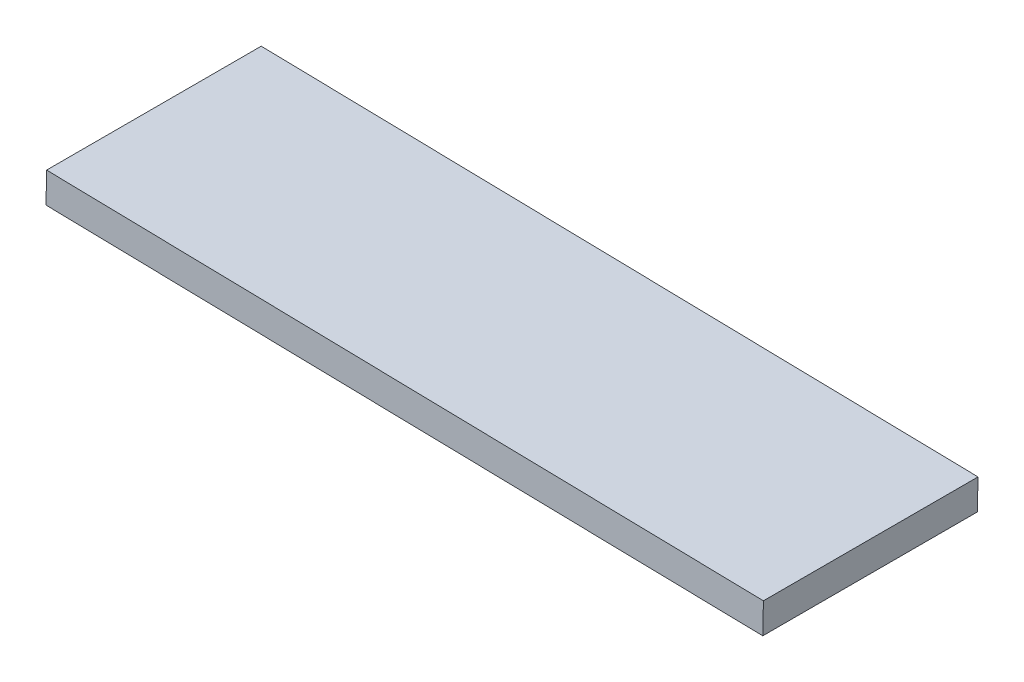
ISO-10303-21;
HEADER;
FILE_DESCRIPTION(('STEP AP214'),'2;1');
FILE_NAME('part.step','',(''),(''),'','','');
FILE_SCHEMA(('AUTOMOTIVE_DESIGN { 1 0 10303 214 1 1 1 1 }'));
ENDSEC;
DATA;
#1=APPLICATION_CONTEXT('core data for automotive mechanical design processes');
#2=APPLICATION_PROTOCOL_DEFINITION('international standard','automotive_design',2000,#1);
#3=PRODUCT_CONTEXT('',#1,'mechanical');
#4=PRODUCT('Part','Part','',(#3));
#5=PRODUCT_RELATED_PRODUCT_CATEGORY('part','',(#4));
#6=PRODUCT_DEFINITION_FORMATION('','',#4);
#7=PRODUCT_DEFINITION_CONTEXT('part definition',#1,'design');
#8=PRODUCT_DEFINITION('design','',#6,#7);
#9=PRODUCT_DEFINITION_SHAPE('','',#8);
#10=(LENGTH_UNIT() NAMED_UNIT(*) SI_UNIT(.MILLI.,.METRE.));
#11=(NAMED_UNIT(*) PLANE_ANGLE_UNIT() SI_UNIT($,.RADIAN.));
#12=(NAMED_UNIT(*) SI_UNIT($,.STERADIAN.) SOLID_ANGLE_UNIT());
#13=UNCERTAINTY_MEASURE_WITH_UNIT(LENGTH_MEASURE(1.E-05),#10,'distance_accuracy_value','');
#14=(GEOMETRIC_REPRESENTATION_CONTEXT(3) GLOBAL_UNCERTAINTY_ASSIGNED_CONTEXT((#13)) GLOBAL_UNIT_ASSIGNED_CONTEXT((#10,
#11,#12)) REPRESENTATION_CONTEXT('',''));
#15=CARTESIAN_POINT('',(0.,0.,0.));
#16=DIRECTION('',(0.,0.,1.));
#17=DIRECTION('',(1.,0.,0.));
#18=AXIS2_PLACEMENT_3D('',#15,#16,#17);
#19=CARTESIAN_POINT('',(41.7461342667819,467.069128536878,35.));
#20=DIRECTION('',(-0.999791479476939,0.0204205182430113,0.));
#21=DIRECTION('',(-0.0204205182430113,-0.999791479476939,0.));
#22=AXIS2_PLACEMENT_3D('',#19,#20,#21);
#23=PLANE('',#22);
#24=DIRECTION('',(0.0204205182430113,0.999791479476939,0.));
#25=VECTOR('',#24,1.);
#26=CARTESIAN_POINT('',(41.7461342667819,467.069128536878,0.));
#27=LINE('',#26,#25);
#28=CARTESIAN_POINT('',(41.7461342667819,467.069128536878,0.));
#29=VERTEX_POINT('',#28);
#30=CARTESIAN_POINT('',(41.848236857997,472.068085934262,0.));
#31=VERTEX_POINT('',#30);
#32=EDGE_CURVE('E96',#29,#31,#27,.T.);
#33=ORIENTED_EDGE('',*,*,#32,.T.);
#34=DIRECTION('',(0.,0.,-1.));
#35=VECTOR('',#34,1.);
#36=CARTESIAN_POINT('',(41.848236857997,472.068085934262,35.));
#37=LINE('',#36,#35);
#38=CARTESIAN_POINT('',(41.848236857997,472.068085934262,35.));
#39=VERTEX_POINT('',#38);
#40=EDGE_CURVE('E11',#39,#31,#37,.T.);
#41=ORIENTED_EDGE('',*,*,#40,.F.);
#42=DIRECTION('',(0.0204205182430113,0.999791479476939,0.));
#43=VECTOR('',#42,1.);
#44=CARTESIAN_POINT('',(41.7461342667819,467.069128536878,35.));
#45=LINE('',#44,#43);
#46=CARTESIAN_POINT('',(41.7461342667819,467.069128536878,35.));
#47=VERTEX_POINT('',#46);
#48=EDGE_CURVE('E84',#47,#39,#45,.T.);
#49=ORIENTED_EDGE('',*,*,#48,.F.);
#50=DIRECTION('',(0.,0.,-1.));
#51=VECTOR('',#50,1.);
#52=CARTESIAN_POINT('',(41.7461342667819,467.069128536878,35.));
#53=LINE('',#52,#51);
#54=EDGE_CURVE('E92',#47,#29,#53,.T.);
#55=ORIENTED_EDGE('',*,*,#54,.T.);
#56=EDGE_LOOP('',(#33,#41,#49,#55));
#57=FACE_BOUND('',#56,.T.);
#58=ADVANCED_FACE('F33',(#57),#23,.F.);
#59=CARTESIAN_POINT('',(41.848236857997,472.068085934262,35.));
#60=DIRECTION('',(-0.0204205182430052,-0.999791479476939,0.));
#61=DIRECTION('',(0.999791479476939,-0.0204205182430052,0.));
#62=AXIS2_PLACEMENT_3D('',#59,#60,#61);
#63=PLANE('',#62);
#64=DIRECTION('',(-0.999791479476939,0.0204205182430052,0.));
#65=VECTOR('',#64,1.);
#66=CARTESIAN_POINT('',(41.848236857997,472.068085934262,0.));
#67=LINE('',#66,#65);
#68=CARTESIAN_POINT('',(-75.0580443891602,474.455870685317,0.));
#69=VERTEX_POINT('',#68);
#70=EDGE_CURVE('E88',#31,#69,#67,.T.);
#71=ORIENTED_EDGE('',*,*,#70,.T.);
#72=DIRECTION('',(0.,0.,-1.));
#73=VECTOR('',#72,1.);
#74=CARTESIAN_POINT('',(-75.0580443891602,474.455870685317,35.));
#75=LINE('',#74,#73);
#76=CARTESIAN_POINT('',(-75.0580443891602,474.455870685317,35.));
#77=VERTEX_POINT('',#76);
#78=EDGE_CURVE('E41',#77,#69,#75,.T.);
#79=ORIENTED_EDGE('',*,*,#78,.F.);
#80=DIRECTION('',(-0.999791479476939,0.0204205182430052,0.));
#81=VECTOR('',#80,1.);
#82=CARTESIAN_POINT('',(41.848236857997,472.068085934262,35.));
#83=LINE('',#82,#81);
#84=EDGE_CURVE('E79',#39,#77,#83,.T.);
#85=ORIENTED_EDGE('',*,*,#84,.F.);
#86=ORIENTED_EDGE('',*,*,#40,.T.);
#87=EDGE_LOOP('',(#71,#79,#85,#86));
#88=FACE_BOUND('',#87,.T.);
#89=ADVANCED_FACE('F87',(#88),#63,.F.);
#90=CARTESIAN_POINT('',(-75.1601469803753,469.456913287932,35.));
#91=DIRECTION('',(0.999791479476939,-0.0204205182430081,0.));
#92=DIRECTION('',(0.0204205182430081,0.999791479476939,0.));
#93=AXIS2_PLACEMENT_3D('',#90,#91,#92);
#94=PLANE('',#93);
#95=DIRECTION('',(-0.0204205182430081,-0.999791479476939,0.));
#96=VECTOR('',#95,1.);
#97=CARTESIAN_POINT('',(-75.1601469803753,469.456913287932,0.));
#98=LINE('',#97,#96);
#99=CARTESIAN_POINT('',(-75.1601469803753,469.456913287932,0.));
#100=VERTEX_POINT('',#99);
#101=EDGE_CURVE('E66',#69,#100,#98,.T.);
#102=ORIENTED_EDGE('',*,*,#101,.T.);
#103=DIRECTION('',(0.,0.,-1.));
#104=VECTOR('',#103,1.);
#105=CARTESIAN_POINT('',(-75.1601469803753,469.456913287932,35.));
#106=LINE('',#105,#104);
#107=CARTESIAN_POINT('',(-75.1601469803753,469.456913287932,35.));
#108=VERTEX_POINT('',#107);
#109=EDGE_CURVE('E89',#108,#100,#106,.T.);
#110=ORIENTED_EDGE('',*,*,#109,.F.);
#111=DIRECTION('',(-0.0204205182430081,-0.999791479476939,0.));
#112=VECTOR('',#111,1.);
#113=CARTESIAN_POINT('',(-75.1601469803753,469.456913287932,35.));
#114=LINE('',#113,#112);
#115=EDGE_CURVE('E82',#77,#108,#114,.T.);
#116=ORIENTED_EDGE('',*,*,#115,.F.);
#117=ORIENTED_EDGE('',*,*,#78,.T.);
#118=EDGE_LOOP('',(#102,#110,#116,#117));
#119=FACE_BOUND('',#118,.T.);
#120=ADVANCED_FACE('F90',(#119),#94,.F.);
#121=CARTESIAN_POINT('',(41.7461342667819,467.069128536878,35.));
#122=DIRECTION('',(0.0204205182430043,0.999791479476939,0.));
#123=DIRECTION('',(-0.999791479476939,0.0204205182430043,0.));
#124=AXIS2_PLACEMENT_3D('',#121,#122,#123);
#125=PLANE('',#124);
#126=DIRECTION('',(0.999791479476939,-0.0204205182430043,0.));
#127=VECTOR('',#126,1.);
#128=CARTESIAN_POINT('',(41.7461342667819,467.069128536878,0.));
#129=LINE('',#128,#127);
#130=EDGE_CURVE('E72',#100,#29,#129,.T.);
#131=ORIENTED_EDGE('',*,*,#130,.T.);
#132=ORIENTED_EDGE('',*,*,#54,.F.);
#133=DIRECTION('',(0.999791479476939,-0.0204205182430043,0.));
#134=VECTOR('',#133,1.);
#135=CARTESIAN_POINT('',(41.7461342667819,467.069128536878,35.));
#136=LINE('',#135,#134);
#137=EDGE_CURVE('E49',#108,#47,#136,.T.);
#138=ORIENTED_EDGE('',*,*,#137,.F.);
#139=ORIENTED_EDGE('',*,*,#109,.T.);
#140=EDGE_LOOP('',(#131,#132,#138,#139));
#141=FACE_BOUND('',#140,.T.);
#142=ADVANCED_FACE('F103',(#141),#125,.F.);
#143=CARTESIAN_POINT('',(0.,0.,35.));
#144=DIRECTION('',(0.,0.,1.));
#145=DIRECTION('',(1.,0.,0.));
#146=AXIS2_PLACEMENT_3D('',#143,#144,#145);
#147=PLANE('',#146);
#148=ORIENTED_EDGE('',*,*,#48,.T.);
#149=ORIENTED_EDGE('',*,*,#84,.T.);
#150=ORIENTED_EDGE('',*,*,#115,.T.);
#151=ORIENTED_EDGE('',*,*,#137,.T.);
#152=EDGE_LOOP('',(#148,#149,#150,#151));
#153=FACE_BOUND('',#152,.T.);
#154=ADVANCED_FACE('F80',(#153),#147,.T.);
#155=CARTESIAN_POINT('',(0.,0.,0.));
#156=DIRECTION('',(0.,0.,1.));
#157=DIRECTION('',(1.,0.,0.));
#158=AXIS2_PLACEMENT_3D('',#155,#156,#157);
#159=PLANE('',#158);
#160=ORIENTED_EDGE('',*,*,#32,.F.);
#161=ORIENTED_EDGE('',*,*,#130,.F.);
#162=ORIENTED_EDGE('',*,*,#101,.F.);
#163=ORIENTED_EDGE('',*,*,#70,.F.);
#164=EDGE_LOOP('',(#160,#161,#162,#163));
#165=FACE_BOUND('',#164,.T.);
#166=ADVANCED_FACE('F106',(#165),#159,.F.);
#167=CLOSED_SHELL('',(#58,#89,#120,#142,#154,#166));
#168=MANIFOLD_SOLID_BREP('B2',#167);
#169=ADVANCED_BREP_SHAPE_REPRESENTATION('',(#18,#168),#14);
#170=SHAPE_DEFINITION_REPRESENTATION(#9,#169);
ENDSEC;
END-ISO-10303-21;
